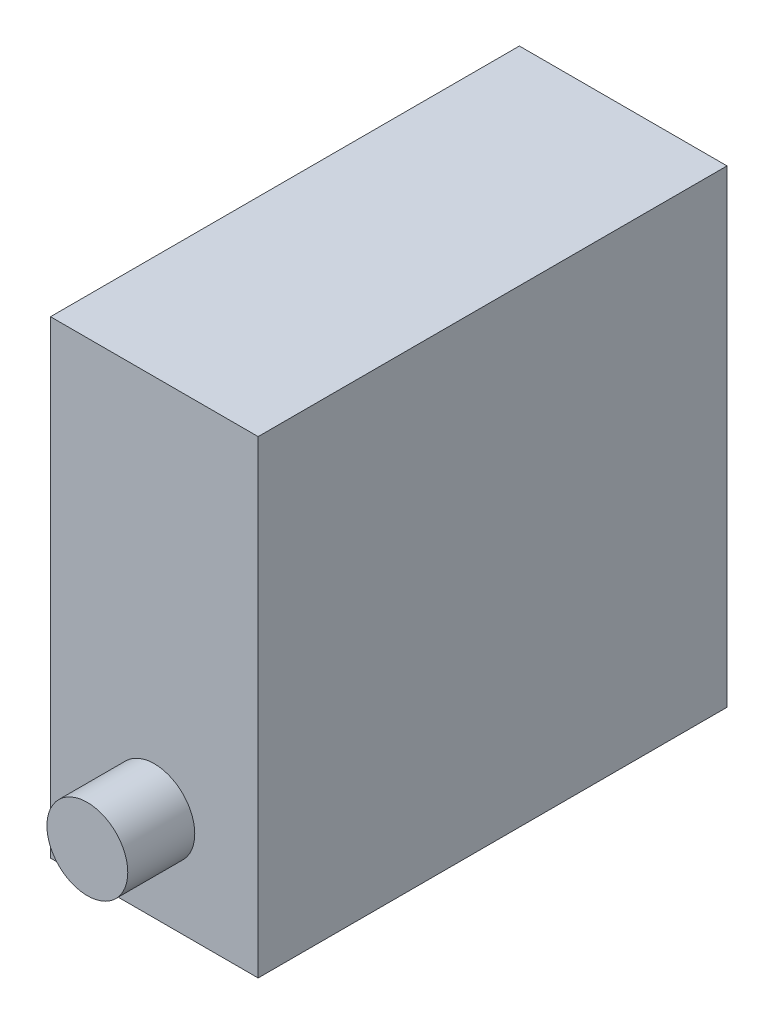
ISO-10303-21;
HEADER;
FILE_DESCRIPTION(('STEP AP214'),'2;1');
FILE_NAME('part.step','',(''),(''),'','','');
FILE_SCHEMA(('AUTOMOTIVE_DESIGN { 1 0 10303 214 1 1 1 1 }'));
ENDSEC;
DATA;
#1=APPLICATION_CONTEXT('core data for automotive mechanical design processes');
#2=APPLICATION_PROTOCOL_DEFINITION('international standard','automotive_design',2000,#1);
#3=PRODUCT_CONTEXT('',#1,'mechanical');
#4=PRODUCT('Part','Part','',(#3));
#5=PRODUCT_RELATED_PRODUCT_CATEGORY('part','',(#4));
#6=PRODUCT_DEFINITION_FORMATION('','',#4);
#7=PRODUCT_DEFINITION_CONTEXT('part definition',#1,'design');
#8=PRODUCT_DEFINITION('design','',#6,#7);
#9=PRODUCT_DEFINITION_SHAPE('','',#8);
#10=(LENGTH_UNIT() NAMED_UNIT(*) SI_UNIT(.MILLI.,.METRE.));
#11=(NAMED_UNIT(*) PLANE_ANGLE_UNIT() SI_UNIT($,.RADIAN.));
#12=(NAMED_UNIT(*) SI_UNIT($,.STERADIAN.) SOLID_ANGLE_UNIT());
#13=UNCERTAINTY_MEASURE_WITH_UNIT(LENGTH_MEASURE(1.E-05),#10,'distance_accuracy_value','');
#14=(GEOMETRIC_REPRESENTATION_CONTEXT(3) GLOBAL_UNCERTAINTY_ASSIGNED_CONTEXT((#13)) GLOBAL_UNIT_ASSIGNED_CONTEXT((#10,
#11,#12)) REPRESENTATION_CONTEXT('',''));
#15=CARTESIAN_POINT('',(0.,0.,0.));
#16=DIRECTION('',(0.,0.,1.));
#17=DIRECTION('',(1.,0.,0.));
#18=AXIS2_PLACEMENT_3D('',#15,#16,#17);
#19=CARTESIAN_POINT('',(0.,0.,14.));
#20=DIRECTION('',(1.,0.,0.));
#21=DIRECTION('',(0.,1.,0.));
#22=AXIS2_PLACEMENT_3D('',#19,#20,#21);
#23=PLANE('',#22);
#24=DIRECTION('',(0.,-1.,0.));
#25=VECTOR('',#24,1.);
#26=CARTESIAN_POINT('',(0.,0.,0.));
#27=LINE('',#26,#25);
#28=CARTESIAN_POINT('',(0.,0.,0.));
#29=VERTEX_POINT('',#28);
#30=CARTESIAN_POINT('',(0.,-14.,0.));
#31=VERTEX_POINT('',#30);
#32=EDGE_CURVE('E103',#29,#31,#27,.T.);
#33=ORIENTED_EDGE('',*,*,#32,.T.);
#34=DIRECTION('',(0.,0.,-1.));
#35=VECTOR('',#34,1.);
#36=CARTESIAN_POINT('',(0.,-14.,14.));
#37=LINE('',#36,#35);
#38=CARTESIAN_POINT('',(0.,-14.,14.));
#39=VERTEX_POINT('',#38);
#40=EDGE_CURVE('E11',#39,#31,#37,.T.);
#41=ORIENTED_EDGE('',*,*,#40,.F.);
#42=DIRECTION('',(0.,-1.,0.));
#43=VECTOR('',#42,1.);
#44=CARTESIAN_POINT('',(0.,0.,14.));
#45=LINE('',#44,#43);
#46=CARTESIAN_POINT('',(0.,0.,14.));
#47=VERTEX_POINT('',#46);
#48=EDGE_CURVE('E91',#47,#39,#45,.T.);
#49=ORIENTED_EDGE('',*,*,#48,.F.);
#50=DIRECTION('',(0.,0.,-1.));
#51=VECTOR('',#50,1.);
#52=CARTESIAN_POINT('',(0.,0.,14.));
#53=LINE('',#52,#51);
#54=EDGE_CURVE('E99',#47,#29,#53,.T.);
#55=ORIENTED_EDGE('',*,*,#54,.T.);
#56=EDGE_LOOP('',(#33,#41,#49,#55));
#57=FACE_BOUND('',#56,.T.);
#58=ADVANCED_FACE('F40',(#57),#23,.F.);
#59=CARTESIAN_POINT('',(0.,-14.,14.));
#60=DIRECTION('',(0.,1.,0.));
#61=DIRECTION('',(0.,0.,1.));
#62=AXIS2_PLACEMENT_3D('',#59,#60,#61);
#63=PLANE('',#62);
#64=DIRECTION('',(1.,0.,0.));
#65=VECTOR('',#64,1.);
#66=CARTESIAN_POINT('',(0.,-14.,0.));
#67=LINE('',#66,#65);
#68=CARTESIAN_POINT('',(6.2,-14.,0.));
#69=VERTEX_POINT('',#68);
#70=EDGE_CURVE('E95',#31,#69,#67,.T.);
#71=ORIENTED_EDGE('',*,*,#70,.T.);
#72=DIRECTION('',(0.,0.,-1.));
#73=VECTOR('',#72,1.);
#74=CARTESIAN_POINT('',(6.2,-14.,14.));
#75=LINE('',#74,#73);
#76=CARTESIAN_POINT('',(6.2,-14.,14.));
#77=VERTEX_POINT('',#76);
#78=EDGE_CURVE('E48',#77,#69,#75,.T.);
#79=ORIENTED_EDGE('',*,*,#78,.F.);
#80=DIRECTION('',(1.,0.,0.));
#81=VECTOR('',#80,1.);
#82=CARTESIAN_POINT('',(0.,-14.,14.));
#83=LINE('',#82,#81);
#84=EDGE_CURVE('E86',#39,#77,#83,.T.);
#85=ORIENTED_EDGE('',*,*,#84,.F.);
#86=ORIENTED_EDGE('',*,*,#40,.T.);
#87=EDGE_LOOP('',(#71,#79,#85,#86));
#88=FACE_BOUND('',#87,.T.);
#89=ADVANCED_FACE('F94',(#88),#63,.F.);
#90=CARTESIAN_POINT('',(6.2,0.,14.));
#91=DIRECTION('',(-1.,0.,0.));
#92=DIRECTION('',(0.,-1.,0.));
#93=AXIS2_PLACEMENT_3D('',#90,#91,#92);
#94=PLANE('',#93);
#95=DIRECTION('',(0.,1.,0.));
#96=VECTOR('',#95,1.);
#97=CARTESIAN_POINT('',(6.2,0.,0.));
#98=LINE('',#97,#96);
#99=CARTESIAN_POINT('',(6.2,0.,0.));
#100=VERTEX_POINT('',#99);
#101=EDGE_CURVE('E73',#69,#100,#98,.T.);
#102=ORIENTED_EDGE('',*,*,#101,.T.);
#103=DIRECTION('',(0.,0.,-1.));
#104=VECTOR('',#103,1.);
#105=CARTESIAN_POINT('',(6.2,0.,14.));
#106=LINE('',#105,#104);
#107=CARTESIAN_POINT('',(6.2,0.,14.));
#108=VERTEX_POINT('',#107);
#109=EDGE_CURVE('E96',#108,#100,#106,.T.);
#110=ORIENTED_EDGE('',*,*,#109,.F.);
#111=DIRECTION('',(0.,1.,0.));
#112=VECTOR('',#111,1.);
#113=CARTESIAN_POINT('',(6.2,0.,14.));
#114=LINE('',#113,#112);
#115=EDGE_CURVE('E89',#77,#108,#114,.T.);
#116=ORIENTED_EDGE('',*,*,#115,.F.);
#117=ORIENTED_EDGE('',*,*,#78,.T.);
#118=EDGE_LOOP('',(#102,#110,#116,#117));
#119=FACE_BOUND('',#118,.T.);
#120=ADVANCED_FACE('F97',(#119),#94,.F.);
#121=CARTESIAN_POINT('',(0.,0.,14.));
#122=DIRECTION('',(0.,-1.,0.));
#123=DIRECTION('',(0.,0.,-1.));
#124=AXIS2_PLACEMENT_3D('',#121,#122,#123);
#125=PLANE('',#124);
#126=DIRECTION('',(-1.,0.,0.));
#127=VECTOR('',#126,1.);
#128=CARTESIAN_POINT('',(0.,0.,0.));
#129=LINE('',#128,#127);
#130=EDGE_CURVE('E79',#100,#29,#129,.T.);
#131=ORIENTED_EDGE('',*,*,#130,.T.);
#132=ORIENTED_EDGE('',*,*,#54,.F.);
#133=DIRECTION('',(-1.,0.,0.));
#134=VECTOR('',#133,1.);
#135=CARTESIAN_POINT('',(0.,0.,14.));
#136=LINE('',#135,#134);
#137=EDGE_CURVE('E56',#108,#47,#136,.T.);
#138=ORIENTED_EDGE('',*,*,#137,.F.);
#139=ORIENTED_EDGE('',*,*,#109,.T.);
#140=EDGE_LOOP('',(#131,#132,#138,#139));
#141=FACE_BOUND('',#140,.T.);
#142=ADVANCED_FACE('F111',(#141),#125,.F.);
#143=CARTESIAN_POINT('',(0.,0.,14.));
#144=DIRECTION('',(0.,0.,1.));
#145=DIRECTION('',(1.,0.,0.));
#146=AXIS2_PLACEMENT_3D('',#143,#144,#145);
#147=PLANE('',#146);
#148=CARTESIAN_POINT('',(3.1,-11.2159763806392,14.));
#149=DIRECTION('',(0.,0.,1.));
#150=DIRECTION('',(1.,0.,0.));
#151=AXIS2_PLACEMENT_3D('',#148,#149,#150);
#152=CIRCLE('',#151,1.20730788897038);
#153=CARTESIAN_POINT('',(4.30730788897038,-11.2159763806392,14.));
#154=VERTEX_POINT('',#153);
#155=EDGE_CURVE('E117',#154,#154,#152,.T.);
#156=ORIENTED_EDGE('',*,*,#155,.F.);
#157=EDGE_LOOP('',(#156));
#158=FACE_BOUND('',#157,.T.);
#159=ORIENTED_EDGE('',*,*,#48,.T.);
#160=ORIENTED_EDGE('',*,*,#84,.T.);
#161=ORIENTED_EDGE('',*,*,#115,.T.);
#162=ORIENTED_EDGE('',*,*,#137,.T.);
#163=EDGE_LOOP('',(#159,#160,#161,#162));
#164=FACE_BOUND('',#163,.T.);
#165=ADVANCED_FACE('F87',(#158,#164),#147,.T.);
#166=CARTESIAN_POINT('',(0.,0.,0.));
#167=DIRECTION('',(0.,0.,1.));
#168=DIRECTION('',(1.,0.,0.));
#169=AXIS2_PLACEMENT_3D('',#166,#167,#168);
#170=PLANE('',#169);
#171=ORIENTED_EDGE('',*,*,#32,.F.);
#172=ORIENTED_EDGE('',*,*,#130,.F.);
#173=ORIENTED_EDGE('',*,*,#101,.F.);
#174=ORIENTED_EDGE('',*,*,#70,.F.);
#175=EDGE_LOOP('',(#171,#172,#173,#174));
#176=FACE_BOUND('',#175,.T.);
#177=ADVANCED_FACE('F114',(#176),#170,.F.);
#178=CARTESIAN_POINT('',(3.1,-11.2159763806392,16.));
#179=DIRECTION('',(0.,0.,-1.));
#180=DIRECTION('',(-1.,0.,0.));
#181=AXIS2_PLACEMENT_3D('',#178,#179,#180);
#182=CYLINDRICAL_SURFACE('',#181,1.20730788897038);
#183=CARTESIAN_POINT('',(3.1,-11.2159763806392,16.));
#184=DIRECTION('',(0.,0.,1.));
#185=DIRECTION('',(1.,0.,0.));
#186=AXIS2_PLACEMENT_3D('',#183,#184,#185);
#187=CIRCLE('',#186,1.20730788897038);
#188=CARTESIAN_POINT('',(4.30730788897038,-11.2159763806392,16.));
#189=VERTEX_POINT('',#188);
#190=EDGE_CURVE('E106',#189,#189,#187,.T.);
#191=ORIENTED_EDGE('',*,*,#190,.F.);
#192=EDGE_LOOP('',(#191));
#193=FACE_BOUND('',#192,.T.);
#194=ORIENTED_EDGE('',*,*,#155,.T.);
#195=EDGE_LOOP('',(#194));
#196=FACE_BOUND('',#195,.T.);
#197=ADVANCED_FACE('F125',(#193,#196),#182,.T.);
#198=CARTESIAN_POINT('',(3.1,-11.2159763806392,16.));
#199=DIRECTION('',(0.,0.,1.));
#200=DIRECTION('',(1.,0.,0.));
#201=AXIS2_PLACEMENT_3D('',#198,#199,#200);
#202=PLANE('',#201);
#203=ORIENTED_EDGE('',*,*,#190,.T.);
#204=EDGE_LOOP('',(#203));
#205=FACE_BOUND('',#204,.T.);
#206=ADVANCED_FACE('F123',(#205),#202,.T.);
#207=CLOSED_SHELL('',(#58,#89,#120,#142,#165,#177,#197,#206));
#208=MANIFOLD_SOLID_BREP('B2',#207);
#209=ADVANCED_BREP_SHAPE_REPRESENTATION('',(#18,#208),#14);
#210=SHAPE_DEFINITION_REPRESENTATION(#9,#209);
ENDSEC;
END-ISO-10303-21;
